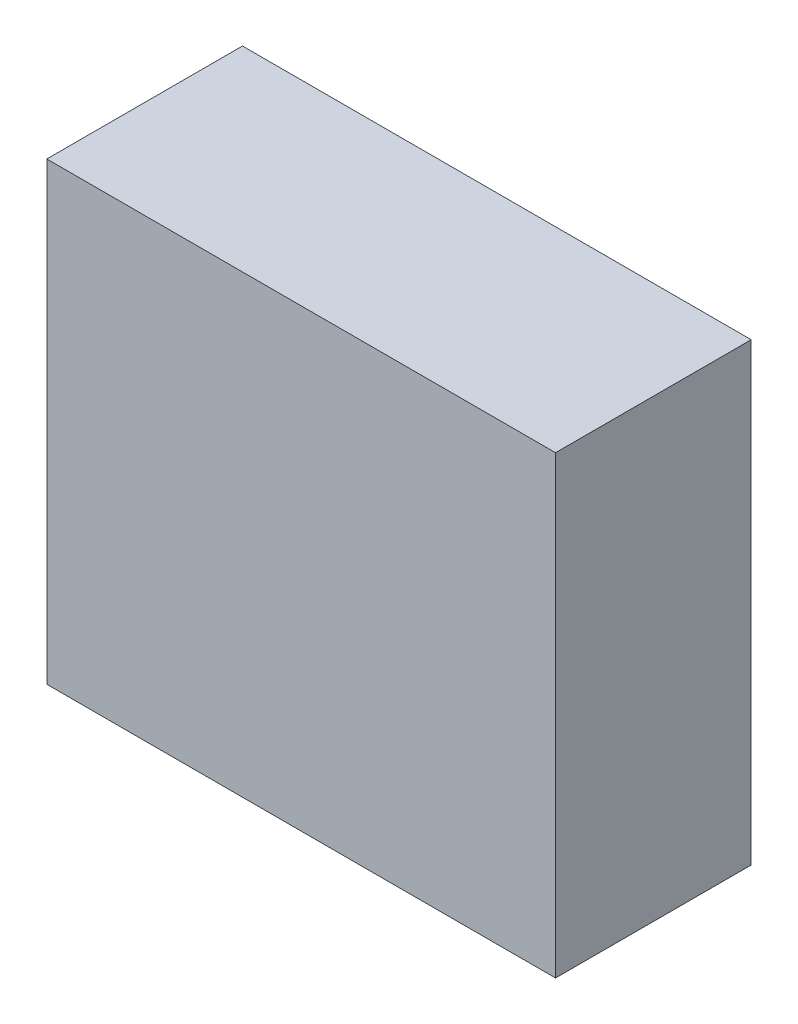
ISO-10303-21;
HEADER;
FILE_DESCRIPTION(('STEP AP214'),'2;1');
FILE_NAME('part.step','',(''),(''),'','','');
FILE_SCHEMA(('AUTOMOTIVE_DESIGN { 1 0 10303 214 1 1 1 1 }'));
ENDSEC;
DATA;
#1=APPLICATION_CONTEXT('core data for automotive mechanical design processes');
#2=APPLICATION_PROTOCOL_DEFINITION('international standard','automotive_design',2000,#1);
#3=PRODUCT_CONTEXT('',#1,'mechanical');
#4=PRODUCT('Part','Part','',(#3));
#5=PRODUCT_RELATED_PRODUCT_CATEGORY('part','',(#4));
#6=PRODUCT_DEFINITION_FORMATION('','',#4);
#7=PRODUCT_DEFINITION_CONTEXT('part definition',#1,'design');
#8=PRODUCT_DEFINITION('design','',#6,#7);
#9=PRODUCT_DEFINITION_SHAPE('','',#8);
#10=(LENGTH_UNIT() NAMED_UNIT(*) SI_UNIT(.MILLI.,.METRE.));
#11=(NAMED_UNIT(*) PLANE_ANGLE_UNIT() SI_UNIT($,.RADIAN.));
#12=(NAMED_UNIT(*) SI_UNIT($,.STERADIAN.) SOLID_ANGLE_UNIT());
#13=UNCERTAINTY_MEASURE_WITH_UNIT(LENGTH_MEASURE(1.E-05),#10,'distance_accuracy_value','');
#14=(GEOMETRIC_REPRESENTATION_CONTEXT(3) GLOBAL_UNCERTAINTY_ASSIGNED_CONTEXT((#13)) GLOBAL_UNIT_ASSIGNED_CONTEXT((#10,
#11,#12)) REPRESENTATION_CONTEXT('',''));
#15=CARTESIAN_POINT('',(0.,0.,0.));
#16=DIRECTION('',(0.,0.,1.));
#17=DIRECTION('',(1.,0.,0.));
#18=AXIS2_PLACEMENT_3D('',#15,#16,#17);
#19=CARTESIAN_POINT('',(22.622717540733,3.947980609798,-18.53448402181));
#20=DIRECTION('',(0.,0.,1.));
#21=DIRECTION('',(1.,0.,0.));
#22=AXIS2_PLACEMENT_3D('',#19,#20,#21);
#23=PLANE('',#22);
#24=DIRECTION('',(1.,0.,0.));
#25=VECTOR('',#24,1.);
#26=CARTESIAN_POINT('',(22.622717540733,13.247980609798,-18.53448402181));
#27=LINE('',#26,#25);
#28=CARTESIAN_POINT('',(22.622717540733,13.247980609798,-18.53448402181));
#29=VERTEX_POINT('',#28);
#30=CARTESIAN_POINT('',(33.022717540733,13.247980609798,-18.53448402181));
#31=VERTEX_POINT('',#30);
#32=EDGE_CURVE('E81',#29,#31,#27,.T.);
#33=ORIENTED_EDGE('',*,*,#32,.T.);
#34=DIRECTION('',(0.,-1.,0.));
#35=VECTOR('',#34,1.);
#36=CARTESIAN_POINT('',(33.022717540733,13.247980609798,-18.53448402181));
#37=LINE('',#36,#35);
#38=CARTESIAN_POINT('',(33.022717540733,3.947980609798,-18.53448402181));
#39=VERTEX_POINT('',#38);
#40=EDGE_CURVE('E68',#31,#39,#37,.T.);
#41=ORIENTED_EDGE('',*,*,#40,.T.);
#42=DIRECTION('',(1.,0.,0.));
#43=VECTOR('',#42,1.);
#44=CARTESIAN_POINT('',(22.622717540733,3.947980609798,-18.53448402181));
#45=LINE('',#44,#43);
#46=CARTESIAN_POINT('',(22.622717540733,3.947980609798,-18.53448402181));
#47=VERTEX_POINT('',#46);
#48=EDGE_CURVE('E55',#39,#47,#45,.F.);
#49=ORIENTED_EDGE('',*,*,#48,.T.);
#50=DIRECTION('',(0.,1.,0.));
#51=VECTOR('',#50,1.);
#52=CARTESIAN_POINT('',(22.622717540733,13.247980609798,-18.53448402181));
#53=LINE('',#52,#51);
#54=EDGE_CURVE('E20',#47,#29,#53,.T.);
#55=ORIENTED_EDGE('',*,*,#54,.T.);
#56=EDGE_LOOP('',(#33,#41,#49,#55));
#57=FACE_BOUND('',#56,.T.);
#58=ADVANCED_FACE('F17',(#57),#23,.F.);
#59=CARTESIAN_POINT('',(22.622717540733,13.247980609798,-14.53448402181));
#60=DIRECTION('',(1.,0.,0.));
#61=DIRECTION('',(0.,1.,0.));
#62=AXIS2_PLACEMENT_3D('',#59,#60,#61);
#63=PLANE('',#62);
#64=DIRECTION('',(0.,0.,1.));
#65=VECTOR('',#64,1.);
#66=CARTESIAN_POINT('',(22.622717540733,3.947980609798,-14.53448402181));
#67=LINE('',#66,#65);
#68=CARTESIAN_POINT('',(22.622717540733,3.947980609798,-14.53448402181));
#69=VERTEX_POINT('',#68);
#70=EDGE_CURVE('E61',#47,#69,#67,.T.);
#71=ORIENTED_EDGE('',*,*,#70,.T.);
#72=DIRECTION('',(0.,1.,0.));
#73=VECTOR('',#72,1.);
#74=CARTESIAN_POINT('',(22.622717540733,3.947980609798,-14.53448402181));
#75=LINE('',#74,#73);
#76=CARTESIAN_POINT('',(22.622717540733,13.247980609798,-14.53448402181));
#77=VERTEX_POINT('',#76);
#78=EDGE_CURVE('E83',#77,#69,#75,.F.);
#79=ORIENTED_EDGE('',*,*,#78,.F.);
#80=DIRECTION('',(0.,0.,-1.));
#81=VECTOR('',#80,1.);
#82=CARTESIAN_POINT('',(22.622717540733,13.247980609798,-14.53448402181));
#83=LINE('',#82,#81);
#84=EDGE_CURVE('E64',#77,#29,#83,.T.);
#85=ORIENTED_EDGE('',*,*,#84,.T.);
#86=ORIENTED_EDGE('',*,*,#54,.F.);
#87=EDGE_LOOP('',(#71,#79,#85,#86));
#88=FACE_BOUND('',#87,.T.);
#89=ADVANCED_FACE('F60',(#88),#63,.F.);
#90=CARTESIAN_POINT('',(22.622717540733,3.947980609798,-14.53448402181));
#91=DIRECTION('',(0.,1.,0.));
#92=DIRECTION('',(0.,0.,1.));
#93=AXIS2_PLACEMENT_3D('',#90,#91,#92);
#94=PLANE('',#93);
#95=DIRECTION('',(0.,0.,1.));
#96=VECTOR('',#95,1.);
#97=CARTESIAN_POINT('',(33.022717540733,3.947980609798,-14.53448402181));
#98=LINE('',#97,#96);
#99=CARTESIAN_POINT('',(33.022717540733,3.947980609798,-14.53448402181));
#100=VERTEX_POINT('',#99);
#101=EDGE_CURVE('E70',#39,#100,#98,.T.);
#102=ORIENTED_EDGE('',*,*,#101,.T.);
#103=DIRECTION('',(1.,0.,0.));
#104=VECTOR('',#103,1.);
#105=CARTESIAN_POINT('',(22.622717540733,3.947980609798,-14.53448402181));
#106=LINE('',#105,#104);
#107=EDGE_CURVE('E74',#69,#100,#106,.T.);
#108=ORIENTED_EDGE('',*,*,#107,.F.);
#109=ORIENTED_EDGE('',*,*,#70,.F.);
#110=ORIENTED_EDGE('',*,*,#48,.F.);
#111=EDGE_LOOP('',(#102,#108,#109,#110));
#112=FACE_BOUND('',#111,.T.);
#113=ADVANCED_FACE('F72',(#112),#94,.F.);
#114=CARTESIAN_POINT('',(33.022717540733,13.247980609798,-14.53448402181));
#115=DIRECTION('',(-1.,0.,0.));
#116=DIRECTION('',(0.,-1.,0.));
#117=AXIS2_PLACEMENT_3D('',#114,#115,#116);
#118=PLANE('',#117);
#119=DIRECTION('',(0.,0.,-1.));
#120=VECTOR('',#119,1.);
#121=CARTESIAN_POINT('',(33.022717540733,13.247980609798,-14.53448402181));
#122=LINE('',#121,#120);
#123=CARTESIAN_POINT('',(33.022717540733,13.247980609798,-14.53448402181));
#124=VERTEX_POINT('',#123);
#125=EDGE_CURVE('E35',#31,#124,#122,.F.);
#126=ORIENTED_EDGE('',*,*,#125,.T.);
#127=DIRECTION('',(0.,1.,0.));
#128=VECTOR('',#127,1.);
#129=CARTESIAN_POINT('',(33.022717540733,3.947980609798,-14.53448402181));
#130=LINE('',#129,#128);
#131=EDGE_CURVE('E26',#100,#124,#130,.T.);
#132=ORIENTED_EDGE('',*,*,#131,.F.);
#133=ORIENTED_EDGE('',*,*,#101,.F.);
#134=ORIENTED_EDGE('',*,*,#40,.F.);
#135=EDGE_LOOP('',(#126,#132,#133,#134));
#136=FACE_BOUND('',#135,.T.);
#137=ADVANCED_FACE('F89',(#136),#118,.F.);
#138=CARTESIAN_POINT('',(22.622717540733,13.247980609798,-14.53448402181));
#139=DIRECTION('',(0.,-1.,0.));
#140=DIRECTION('',(0.,0.,-1.));
#141=AXIS2_PLACEMENT_3D('',#138,#139,#140);
#142=PLANE('',#141);
#143=ORIENTED_EDGE('',*,*,#84,.F.);
#144=DIRECTION('',(1.,0.,0.));
#145=VECTOR('',#144,1.);
#146=CARTESIAN_POINT('',(22.622717540733,13.247980609798,-14.53448402181));
#147=LINE('',#146,#145);
#148=EDGE_CURVE('E11',#124,#77,#147,.F.);
#149=ORIENTED_EDGE('',*,*,#148,.F.);
#150=ORIENTED_EDGE('',*,*,#125,.F.);
#151=ORIENTED_EDGE('',*,*,#32,.F.);
#152=EDGE_LOOP('',(#143,#149,#150,#151));
#153=FACE_BOUND('',#152,.T.);
#154=ADVANCED_FACE('F91',(#153),#142,.F.);
#155=CARTESIAN_POINT('',(22.622717540733,3.947980609798,-14.53448402181));
#156=DIRECTION('',(0.,0.,1.));
#157=DIRECTION('',(1.,0.,0.));
#158=AXIS2_PLACEMENT_3D('',#155,#156,#157);
#159=PLANE('',#158);
#160=ORIENTED_EDGE('',*,*,#131,.T.);
#161=ORIENTED_EDGE('',*,*,#148,.T.);
#162=ORIENTED_EDGE('',*,*,#78,.T.);
#163=ORIENTED_EDGE('',*,*,#107,.T.);
#164=EDGE_LOOP('',(#160,#161,#162,#163));
#165=FACE_BOUND('',#164,.T.);
#166=ADVANCED_FACE('F88',(#165),#159,.T.);
#167=CLOSED_SHELL('',(#58,#89,#113,#137,#154,#166));
#168=MANIFOLD_SOLID_BREP('B1',#167);
#169=ADVANCED_BREP_SHAPE_REPRESENTATION('',(#18,#168),#14);
#170=SHAPE_DEFINITION_REPRESENTATION(#9,#169);
ENDSEC;
END-ISO-10303-21;
